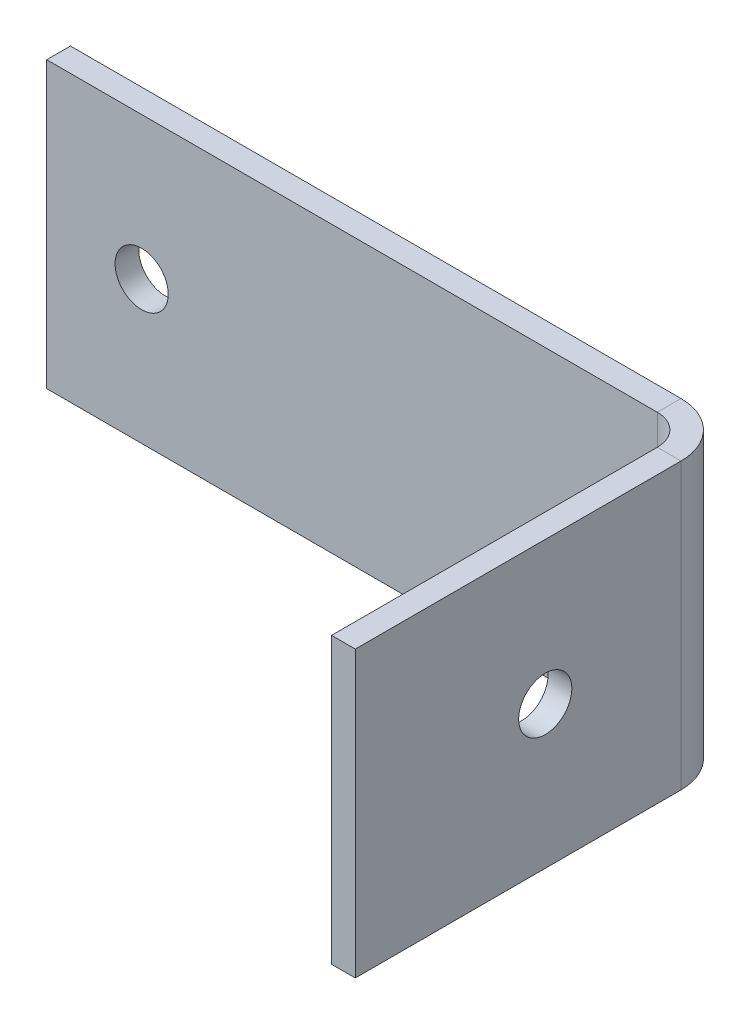
ISO-10303-21;
HEADER;
FILE_DESCRIPTION(('STEP AP214'),'2;1');
FILE_NAME('part.step','',(''),(''),'','','');
FILE_SCHEMA(('AUTOMOTIVE_DESIGN { 1 0 10303 214 1 1 1 1 }'));
ENDSEC;
DATA;
#1=APPLICATION_CONTEXT('core data for automotive mechanical design processes');
#2=APPLICATION_PROTOCOL_DEFINITION('international standard','automotive_design',2000,#1);
#3=PRODUCT_CONTEXT('',#1,'mechanical');
#4=PRODUCT('Part','Part','',(#3));
#5=PRODUCT_RELATED_PRODUCT_CATEGORY('part','',(#4));
#6=PRODUCT_DEFINITION_FORMATION('','',#4);
#7=PRODUCT_DEFINITION_CONTEXT('part definition',#1,'design');
#8=PRODUCT_DEFINITION('design','',#6,#7);
#9=PRODUCT_DEFINITION_SHAPE('','',#8);
#10=(LENGTH_UNIT() NAMED_UNIT(*) SI_UNIT(.MILLI.,.METRE.));
#11=(NAMED_UNIT(*) PLANE_ANGLE_UNIT() SI_UNIT($,.RADIAN.));
#12=(NAMED_UNIT(*) SI_UNIT($,.STERADIAN.) SOLID_ANGLE_UNIT());
#13=UNCERTAINTY_MEASURE_WITH_UNIT(LENGTH_MEASURE(1.E-05),#10,'distance_accuracy_value','');
#14=(GEOMETRIC_REPRESENTATION_CONTEXT(3) GLOBAL_UNCERTAINTY_ASSIGNED_CONTEXT((#13)) GLOBAL_UNIT_ASSIGNED_CONTEXT((#10,
#11,#12)) REPRESENTATION_CONTEXT('',''));
#15=CARTESIAN_POINT('',(0.,0.,0.));
#16=DIRECTION('',(0.,0.,1.));
#17=DIRECTION('',(1.,0.,0.));
#18=AXIS2_PLACEMENT_3D('',#15,#16,#17);
#19=CARTESIAN_POINT('',(0.,0.,3.175));
#20=DIRECTION('',(0.,0.,1.));
#21=DIRECTION('',(1.,0.,0.));
#22=AXIS2_PLACEMENT_3D('',#19,#20,#21);
#23=PLANE('',#22);
#24=CARTESIAN_POINT('',(-88.9000000000001,88.8999999999999,3.175));
#25=DIRECTION('',(0.,0.,1.));
#26=DIRECTION('',(1.,0.,0.));
#27=AXIS2_PLACEMENT_3D('',#24,#25,#26);
#28=CIRCLE('',#27,3.556);
#29=CARTESIAN_POINT('',(-85.3440000000001,88.8999999999999,3.175));
#30=VERTEX_POINT('',#29);
#31=EDGE_CURVE('E192',#30,#30,#28,.T.);
#32=ORIENTED_EDGE('',*,*,#31,.F.);
#33=EDGE_LOOP('',(#32));
#34=FACE_BOUND('',#33,.T.);
#35=DIRECTION('',(1.,0.,0.));
#36=VECTOR('',#35,1.);
#37=CARTESIAN_POINT('',(-101.6,69.8499999999999,3.175));
#38=LINE('',#37,#36);
#39=CARTESIAN_POINT('',(-101.6,69.8499999999999,3.175));
#40=VERTEX_POINT('',#39);
#41=CARTESIAN_POINT('',(-19.935,69.8499999999999,3.175));
#42=VERTEX_POINT('',#41);
#43=EDGE_CURVE('E201',#40,#42,#38,.T.);
#44=ORIENTED_EDGE('',*,*,#43,.T.);
#45=DIRECTION('',(0.,1.,0.));
#46=VECTOR('',#45,1.);
#47=CARTESIAN_POINT('',(-19.935,107.95,3.175));
#48=LINE('',#47,#46);
#49=CARTESIAN_POINT('',(-19.935,107.95,3.175));
#50=VERTEX_POINT('',#49);
#51=EDGE_CURVE('E182',#50,#42,#48,.F.);
#52=ORIENTED_EDGE('',*,*,#51,.F.);
#53=DIRECTION('',(-1.,0.,0.));
#54=VECTOR('',#53,1.);
#55=CARTESIAN_POINT('',(-101.6,107.95,3.175));
#56=LINE('',#55,#54);
#57=CARTESIAN_POINT('',(-101.6,107.95,3.175));
#58=VERTEX_POINT('',#57);
#59=EDGE_CURVE('E204',#50,#58,#56,.T.);
#60=ORIENTED_EDGE('',*,*,#59,.T.);
#61=DIRECTION('',(0.,-1.,0.));
#62=VECTOR('',#61,1.);
#63=CARTESIAN_POINT('',(-101.6,107.95,3.175));
#64=LINE('',#63,#62);
#65=EDGE_CURVE('E198',#58,#40,#64,.T.);
#66=ORIENTED_EDGE('',*,*,#65,.T.);
#67=EDGE_LOOP('',(#44,#52,#60,#66));
#68=FACE_BOUND('',#67,.T.);
#69=ADVANCED_FACE('F64',(#34,#68),#23,.T.);
#70=CARTESIAN_POINT('',(0.,0.,0.));
#71=DIRECTION('',(0.,0.,1.));
#72=DIRECTION('',(1.,0.,0.));
#73=AXIS2_PLACEMENT_3D('',#70,#71,#72);
#74=PLANE('',#73);
#75=CARTESIAN_POINT('',(-88.9000000000001,88.8999999999999,0.));
#76=DIRECTION('',(0.,0.,1.));
#77=DIRECTION('',(1.,0.,0.));
#78=AXIS2_PLACEMENT_3D('',#75,#76,#77);
#79=CIRCLE('',#78,3.556);
#80=CARTESIAN_POINT('',(-85.3440000000001,88.8999999999999,0.));
#81=VERTEX_POINT('',#80);
#82=EDGE_CURVE('E189',#81,#81,#79,.T.);
#83=ORIENTED_EDGE('',*,*,#82,.T.);
#84=EDGE_LOOP('',(#83));
#85=FACE_BOUND('',#84,.T.);
#86=DIRECTION('',(0.,1.,0.));
#87=VECTOR('',#86,1.);
#88=CARTESIAN_POINT('',(-19.935,107.95,0.));
#89=LINE('',#88,#87);
#90=CARTESIAN_POINT('',(-19.935,107.95,0.));
#91=VERTEX_POINT('',#90);
#92=CARTESIAN_POINT('',(-19.935,69.8499999999999,0.));
#93=VERTEX_POINT('',#92);
#94=EDGE_CURVE('E87',#91,#93,#89,.F.);
#95=ORIENTED_EDGE('',*,*,#94,.T.);
#96=DIRECTION('',(1.,0.,0.));
#97=VECTOR('',#96,1.);
#98=CARTESIAN_POINT('',(-101.6,69.8499999999999,0.));
#99=LINE('',#98,#97);
#100=CARTESIAN_POINT('',(-101.6,69.8499999999999,0.));
#101=VERTEX_POINT('',#100);
#102=EDGE_CURVE('E208',#101,#93,#99,.T.);
#103=ORIENTED_EDGE('',*,*,#102,.F.);
#104=DIRECTION('',(0.,-1.,0.));
#105=VECTOR('',#104,1.);
#106=CARTESIAN_POINT('',(-101.6,107.95,0.));
#107=LINE('',#106,#105);
#108=CARTESIAN_POINT('',(-101.6,107.95,0.));
#109=VERTEX_POINT('',#108);
#110=EDGE_CURVE('E195',#109,#101,#107,.T.);
#111=ORIENTED_EDGE('',*,*,#110,.F.);
#112=DIRECTION('',(-1.,0.,0.));
#113=VECTOR('',#112,1.);
#114=CARTESIAN_POINT('',(-101.6,107.95,0.));
#115=LINE('',#114,#113);
#116=EDGE_CURVE('E202',#91,#109,#115,.T.);
#117=ORIENTED_EDGE('',*,*,#116,.F.);
#118=EDGE_LOOP('',(#95,#103,#111,#117));
#119=FACE_BOUND('',#118,.T.);
#120=ADVANCED_FACE('F217',(#85,#119),#74,.F.);
#121=CARTESIAN_POINT('',(-101.6,69.8499999999999,3.175));
#122=DIRECTION('',(0.,1.,0.));
#123=DIRECTION('',(0.,0.,1.));
#124=AXIS2_PLACEMENT_3D('',#121,#122,#123);
#125=PLANE('',#124);
#126=DIRECTION('',(0.,0.,-1.));
#127=VECTOR('',#126,1.);
#128=CARTESIAN_POINT('',(-19.935,69.8499999999999,3.175));
#129=LINE('',#128,#127);
#130=EDGE_CURVE('E79',#42,#93,#129,.T.);
#131=ORIENTED_EDGE('',*,*,#130,.F.);
#132=ORIENTED_EDGE('',*,*,#43,.F.);
#133=DIRECTION('',(0.,0.,-1.));
#134=VECTOR('',#133,1.);
#135=CARTESIAN_POINT('',(-101.6,69.8499999999999,3.175));
#136=LINE('',#135,#134);
#137=EDGE_CURVE('E13',#40,#101,#136,.T.);
#138=ORIENTED_EDGE('',*,*,#137,.T.);
#139=ORIENTED_EDGE('',*,*,#102,.T.);
#140=EDGE_LOOP('',(#131,#132,#138,#139));
#141=FACE_BOUND('',#140,.T.);
#142=ADVANCED_FACE('F218',(#141),#125,.F.);
#143=CARTESIAN_POINT('',(-101.6,107.95,3.175));
#144=DIRECTION('',(0.,-1.,0.));
#145=DIRECTION('',(0.,0.,-1.));
#146=AXIS2_PLACEMENT_3D('',#143,#144,#145);
#147=PLANE('',#146);
#148=DIRECTION('',(0.,0.,-1.));
#149=VECTOR('',#148,1.);
#150=CARTESIAN_POINT('',(-19.935,107.95,3.175));
#151=LINE('',#150,#149);
#152=EDGE_CURVE('E176',#50,#91,#151,.T.);
#153=ORIENTED_EDGE('',*,*,#152,.T.);
#154=ORIENTED_EDGE('',*,*,#116,.T.);
#155=DIRECTION('',(0.,0.,-1.));
#156=VECTOR('',#155,1.);
#157=CARTESIAN_POINT('',(-101.6,107.95,3.175));
#158=LINE('',#157,#156);
#159=EDGE_CURVE('E72',#58,#109,#158,.T.);
#160=ORIENTED_EDGE('',*,*,#159,.F.);
#161=ORIENTED_EDGE('',*,*,#59,.F.);
#162=EDGE_LOOP('',(#153,#154,#160,#161));
#163=FACE_BOUND('',#162,.T.);
#164=ADVANCED_FACE('F222',(#163),#147,.F.);
#165=CARTESIAN_POINT('',(-101.6,107.95,3.175));
#166=DIRECTION('',(1.,0.,0.));
#167=DIRECTION('',(0.,0.,-1.));
#168=AXIS2_PLACEMENT_3D('',#165,#166,#167);
#169=PLANE('',#168);
#170=ORIENTED_EDGE('',*,*,#110,.T.);
#171=ORIENTED_EDGE('',*,*,#137,.F.);
#172=ORIENTED_EDGE('',*,*,#65,.F.);
#173=ORIENTED_EDGE('',*,*,#159,.T.);
#174=EDGE_LOOP('',(#170,#171,#172,#173));
#175=FACE_BOUND('',#174,.T.);
#176=ADVANCED_FACE('F66',(#175),#169,.F.);
#177=CARTESIAN_POINT('',(-88.9000000000001,88.8999999999999,3.175));
#178=DIRECTION('',(0.,0.,-1.));
#179=DIRECTION('',(-1.,0.,0.));
#180=AXIS2_PLACEMENT_3D('',#177,#178,#179);
#181=CYLINDRICAL_SURFACE('',#180,3.556);
#182=ORIENTED_EDGE('',*,*,#31,.T.);
#183=EDGE_LOOP('',(#182));
#184=FACE_BOUND('',#183,.T.);
#185=ORIENTED_EDGE('',*,*,#82,.F.);
#186=EDGE_LOOP('',(#185));
#187=FACE_BOUND('',#186,.T.);
#188=ADVANCED_FACE('F259',(#184,#187),#181,.F.);
#189=CARTESIAN_POINT('',(-19.935,69.8499999999999,7.235));
#190=DIRECTION('',(0.,-1.,0.));
#191=DIRECTION('',(0.,0.,-1.));
#192=AXIS2_PLACEMENT_3D('',#189,#190,#191);
#193=PLANE('',#192);
#194=DIRECTION('',(-1.,0.,0.));
#195=VECTOR('',#194,1.);
#196=CARTESIAN_POINT('',(-12.7,69.8499999999999,7.23499999999998));
#197=LINE('',#196,#195);
#198=CARTESIAN_POINT('',(-15.875,69.8499999999999,7.23499999999999));
#199=VERTEX_POINT('',#198);
#200=CARTESIAN_POINT('',(-12.7,69.8499999999999,7.23499999999998));
#201=VERTEX_POINT('',#200);
#202=EDGE_CURVE('E153',#199,#201,#197,.F.);
#203=ORIENTED_EDGE('',*,*,#202,.F.);
#204=CARTESIAN_POINT('',(-19.935,69.8499999999999,7.235));
#205=DIRECTION('',(0.,1.,0.));
#206=DIRECTION('',(0.,0.,1.));
#207=AXIS2_PLACEMENT_3D('',#204,#205,#206);
#208=CIRCLE('',#207,4.06);
#209=EDGE_CURVE('E179',#42,#199,#208,.F.);
#210=ORIENTED_EDGE('',*,*,#209,.F.);
#211=ORIENTED_EDGE('',*,*,#130,.T.);
#212=CARTESIAN_POINT('',(-19.935,69.8499999999999,7.235));
#213=DIRECTION('',(0.,1.,0.));
#214=DIRECTION('',(0.,0.,1.));
#215=AXIS2_PLACEMENT_3D('',#212,#213,#214);
#216=CIRCLE('',#215,7.235);
#217=EDGE_CURVE('E172',#93,#201,#216,.F.);
#218=ORIENTED_EDGE('',*,*,#217,.T.);
#219=EDGE_LOOP('',(#203,#210,#211,#218));
#220=FACE_BOUND('',#219,.T.);
#221=ADVANCED_FACE('F257',(#220),#193,.T.);
#222=CARTESIAN_POINT('',(-19.935,107.95,7.235));
#223=DIRECTION('',(0.,-1.,0.));
#224=DIRECTION('',(0.,0.,-1.));
#225=AXIS2_PLACEMENT_3D('',#222,#223,#224);
#226=PLANE('',#225);
#227=CARTESIAN_POINT('',(-19.935,107.95,7.235));
#228=DIRECTION('',(0.,1.,0.));
#229=DIRECTION('',(0.,0.,1.));
#230=AXIS2_PLACEMENT_3D('',#227,#228,#229);
#231=CIRCLE('',#230,4.06);
#232=CARTESIAN_POINT('',(-15.875,107.95,7.23499999999999));
#233=VERTEX_POINT('',#232);
#234=EDGE_CURVE('E185',#233,#50,#231,.T.);
#235=ORIENTED_EDGE('',*,*,#234,.F.);
#236=DIRECTION('',(-1.,0.,0.));
#237=VECTOR('',#236,1.);
#238=CARTESIAN_POINT('',(-15.875,107.95,7.23499999999999));
#239=LINE('',#238,#237);
#240=CARTESIAN_POINT('',(-12.7,107.95,7.23499999999998));
#241=VERTEX_POINT('',#240);
#242=EDGE_CURVE('E164',#233,#241,#239,.F.);
#243=ORIENTED_EDGE('',*,*,#242,.T.);
#244=CARTESIAN_POINT('',(-19.935,107.95,7.235));
#245=DIRECTION('',(0.,1.,0.));
#246=DIRECTION('',(0.,0.,1.));
#247=AXIS2_PLACEMENT_3D('',#244,#245,#246);
#248=CIRCLE('',#247,7.235);
#249=EDGE_CURVE('E173',#241,#91,#248,.T.);
#250=ORIENTED_EDGE('',*,*,#249,.T.);
#251=ORIENTED_EDGE('',*,*,#152,.F.);
#252=EDGE_LOOP('',(#235,#243,#250,#251));
#253=FACE_BOUND('',#252,.T.);
#254=ADVANCED_FACE('F228',(#253),#226,.F.);
#255=CARTESIAN_POINT('',(-19.935,107.95,7.235));
#256=DIRECTION('',(0.,1.,0.));
#257=DIRECTION('',(1.,0.,0.));
#258=AXIS2_PLACEMENT_3D('',#255,#256,#257);
#259=CYLINDRICAL_SURFACE('',#258,7.235);
#260=ORIENTED_EDGE('',*,*,#94,.F.);
#261=ORIENTED_EDGE('',*,*,#249,.F.);
#262=DIRECTION('',(0.,1.,0.));
#263=VECTOR('',#262,1.);
#264=CARTESIAN_POINT('',(-12.7,69.8499999999999,7.23499999999998));
#265=LINE('',#264,#263);
#266=EDGE_CURVE('E162',#241,#201,#265,.F.);
#267=ORIENTED_EDGE('',*,*,#266,.T.);
#268=ORIENTED_EDGE('',*,*,#217,.F.);
#269=EDGE_LOOP('',(#260,#261,#267,#268));
#270=FACE_BOUND('',#269,.T.);
#271=ADVANCED_FACE('F227',(#270),#259,.T.);
#272=CARTESIAN_POINT('',(-19.935,107.95,7.235));
#273=DIRECTION('',(0.,1.,0.));
#274=DIRECTION('',(1.,0.,0.));
#275=AXIS2_PLACEMENT_3D('',#272,#273,#274);
#276=CYLINDRICAL_SURFACE('',#275,4.06);
#277=ORIENTED_EDGE('',*,*,#51,.T.);
#278=ORIENTED_EDGE('',*,*,#209,.T.);
#279=DIRECTION('',(0.,1.,0.));
#280=VECTOR('',#279,1.);
#281=CARTESIAN_POINT('',(-15.875,69.8499999999999,7.23499999999999));
#282=LINE('',#281,#280);
#283=EDGE_CURVE('E167',#199,#233,#282,.T.);
#284=ORIENTED_EDGE('',*,*,#283,.T.);
#285=ORIENTED_EDGE('',*,*,#234,.T.);
#286=EDGE_LOOP('',(#277,#278,#284,#285));
#287=FACE_BOUND('',#286,.T.);
#288=ADVANCED_FACE('F254',(#287),#276,.F.);
#289=CARTESIAN_POINT('',(-12.7,69.8499999999999,3.17499999999999));
#290=DIRECTION('',(0.,1.,0.));
#291=DIRECTION('',(0.,0.,1.));
#292=AXIS2_PLACEMENT_3D('',#289,#290,#291);
#293=PLANE('',#292);
#294=ORIENTED_EDGE('',*,*,#202,.T.);
#295=DIRECTION('',(0.,0.,-1.));
#296=VECTOR('',#295,1.);
#297=CARTESIAN_POINT('',(-12.7,69.8499999999999,0.));
#298=LINE('',#297,#296);
#299=CARTESIAN_POINT('',(-12.6999999999999,69.8499999999999,50.7999999999996));
#300=VERTEX_POINT('',#299);
#301=EDGE_CURVE('E134',#300,#201,#298,.T.);
#302=ORIENTED_EDGE('',*,*,#301,.F.);
#303=DIRECTION('',(-1.,0.,0.));
#304=VECTOR('',#303,1.);
#305=CARTESIAN_POINT('',(-12.6999999999999,69.8499999999999,50.7999999999996));
#306=LINE('',#305,#304);
#307=CARTESIAN_POINT('',(-15.8749999999999,69.8499999999999,50.7999999999996));
#308=VERTEX_POINT('',#307);
#309=EDGE_CURVE('E140',#300,#308,#306,.T.);
#310=ORIENTED_EDGE('',*,*,#309,.T.);
#311=DIRECTION('',(0.,0.,1.));
#312=VECTOR('',#311,1.);
#313=CARTESIAN_POINT('',(-15.875,69.8499999999999,3.175));
#314=LINE('',#313,#312);
#315=EDGE_CURVE('E160',#308,#199,#314,.F.);
#316=ORIENTED_EDGE('',*,*,#315,.T.);
#317=EDGE_LOOP('',(#294,#302,#310,#316));
#318=FACE_BOUND('',#317,.T.);
#319=ADVANCED_FACE('F152',(#318),#293,.F.);
#320=CARTESIAN_POINT('',(-12.6999999999999,107.95,50.7999999999996));
#321=DIRECTION('',(0.,-1.,0.));
#322=DIRECTION('',(0.,0.,-1.));
#323=AXIS2_PLACEMENT_3D('',#320,#321,#322);
#324=PLANE('',#323);
#325=ORIENTED_EDGE('',*,*,#242,.F.);
#326=DIRECTION('',(0.,0.,-1.));
#327=VECTOR('',#326,1.);
#328=CARTESIAN_POINT('',(-15.8749999999999,107.95,50.7999999999996));
#329=LINE('',#328,#327);
#330=CARTESIAN_POINT('',(-15.8749999999999,107.95,50.7999999999996));
#331=VERTEX_POINT('',#330);
#332=EDGE_CURVE('E156',#233,#331,#329,.F.);
#333=ORIENTED_EDGE('',*,*,#332,.T.);
#334=DIRECTION('',(-1.,0.,0.));
#335=VECTOR('',#334,1.);
#336=CARTESIAN_POINT('',(-12.6999999999999,107.95,50.7999999999996));
#337=LINE('',#336,#335);
#338=CARTESIAN_POINT('',(-12.6999999999999,107.95,50.7999999999996));
#339=VERTEX_POINT('',#338);
#340=EDGE_CURVE('E149',#339,#331,#337,.T.);
#341=ORIENTED_EDGE('',*,*,#340,.F.);
#342=DIRECTION('',(0.,0.,1.));
#343=VECTOR('',#342,1.);
#344=CARTESIAN_POINT('',(-12.7,107.95,0.));
#345=LINE('',#344,#343);
#346=EDGE_CURVE('E136',#241,#339,#345,.T.);
#347=ORIENTED_EDGE('',*,*,#346,.F.);
#348=EDGE_LOOP('',(#325,#333,#341,#347));
#349=FACE_BOUND('',#348,.T.);
#350=ADVANCED_FACE('F232',(#349),#324,.F.);
#351=CARTESIAN_POINT('',(-12.7,0.,0.));
#352=DIRECTION('',(-1.,0.,0.));
#353=DIRECTION('',(0.,0.,1.));
#354=AXIS2_PLACEMENT_3D('',#351,#352,#353);
#355=PLANE('',#354);
#356=CARTESIAN_POINT('',(-12.6999999999998,88.8999999999999,25.3999999999999));
#357=DIRECTION('',(-1.,0.,0.));
#358=DIRECTION('',(0.,0.,1.));
#359=AXIS2_PLACEMENT_3D('',#356,#357,#358);
#360=CIRCLE('',#359,3.556);
#361=CARTESIAN_POINT('',(-12.6999999999998,88.8999999999999,28.9559999999999));
#362=VERTEX_POINT('',#361);
#363=EDGE_CURVE('E170',#362,#362,#360,.T.);
#364=ORIENTED_EDGE('',*,*,#363,.T.);
#365=EDGE_LOOP('',(#364));
#366=FACE_BOUND('',#365,.T.);
#367=ORIENTED_EDGE('',*,*,#266,.F.);
#368=ORIENTED_EDGE('',*,*,#346,.T.);
#369=DIRECTION('',(0.,-1.,0.));
#370=VECTOR('',#369,1.);
#371=CARTESIAN_POINT('',(-12.6999999999999,0.,50.7999999999996));
#372=LINE('',#371,#370);
#373=EDGE_CURVE('E129',#339,#300,#372,.T.);
#374=ORIENTED_EDGE('',*,*,#373,.T.);
#375=ORIENTED_EDGE('',*,*,#301,.T.);
#376=EDGE_LOOP('',(#367,#368,#374,#375));
#377=FACE_BOUND('',#376,.T.);
#378=ADVANCED_FACE('F132',(#366,#377),#355,.F.);
#379=CARTESIAN_POINT('',(-15.875,0.,0.));
#380=DIRECTION('',(-1.,0.,0.));
#381=DIRECTION('',(0.,0.,1.));
#382=AXIS2_PLACEMENT_3D('',#379,#380,#381);
#383=PLANE('',#382);
#384=CARTESIAN_POINT('',(-15.875,88.8999999999999,25.3999999999999));
#385=DIRECTION('',(-1.,0.,0.));
#386=DIRECTION('',(0.,0.,1.));
#387=AXIS2_PLACEMENT_3D('',#384,#385,#386);
#388=CIRCLE('',#387,3.556);
#389=CARTESIAN_POINT('',(-15.8749999999999,88.8999999999999,28.9559999999999));
#390=VERTEX_POINT('',#389);
#391=EDGE_CURVE('E235',#390,#390,#388,.T.);
#392=ORIENTED_EDGE('',*,*,#391,.F.);
#393=EDGE_LOOP('',(#392));
#394=FACE_BOUND('',#393,.T.);
#395=ORIENTED_EDGE('',*,*,#332,.F.);
#396=ORIENTED_EDGE('',*,*,#283,.F.);
#397=ORIENTED_EDGE('',*,*,#315,.F.);
#398=DIRECTION('',(0.,1.,0.));
#399=VECTOR('',#398,1.);
#400=CARTESIAN_POINT('',(-15.8749999999999,69.8499999999999,50.7999999999996));
#401=LINE('',#400,#399);
#402=EDGE_CURVE('E145',#331,#308,#401,.F.);
#403=ORIENTED_EDGE('',*,*,#402,.F.);
#404=EDGE_LOOP('',(#395,#396,#397,#403));
#405=FACE_BOUND('',#404,.T.);
#406=ADVANCED_FACE('F248',(#394,#405),#383,.T.);
#407=CARTESIAN_POINT('',(-12.6999999999999,69.8499999999999,50.7999999999996));
#408=DIRECTION('',(0.,0.,-1.));
#409=DIRECTION('',(-1.,0.,0.));
#410=AXIS2_PLACEMENT_3D('',#407,#408,#409);
#411=PLANE('',#410);
#412=ORIENTED_EDGE('',*,*,#402,.T.);
#413=ORIENTED_EDGE('',*,*,#309,.F.);
#414=ORIENTED_EDGE('',*,*,#373,.F.);
#415=ORIENTED_EDGE('',*,*,#340,.T.);
#416=EDGE_LOOP('',(#412,#413,#414,#415));
#417=FACE_BOUND('',#416,.T.);
#418=ADVANCED_FACE('F143',(#417),#411,.F.);
#419=CARTESIAN_POINT('',(-12.6999999999998,88.8999999999999,25.3999999999999));
#420=DIRECTION('',(-1.,0.,0.));
#421=DIRECTION('',(0.,0.,1.));
#422=AXIS2_PLACEMENT_3D('',#419,#420,#421);
#423=CYLINDRICAL_SURFACE('',#422,3.556);
#424=ORIENTED_EDGE('',*,*,#363,.F.);
#425=EDGE_LOOP('',(#424));
#426=FACE_BOUND('',#425,.T.);
#427=ORIENTED_EDGE('',*,*,#391,.T.);
#428=EDGE_LOOP('',(#427));
#429=FACE_BOUND('',#428,.T.);
#430=ADVANCED_FACE('F242',(#426,#429),#423,.F.);
#431=CLOSED_SHELL('',(#69,#120,#142,#164,#176,#188,#221,#254,#271,#288,#319,#350,#378,#406,#418,#430));
#432=MANIFOLD_SOLID_BREP('B2',#431);
#433=ADVANCED_BREP_SHAPE_REPRESENTATION('',(#18,#432),#14);
#434=SHAPE_DEFINITION_REPRESENTATION(#9,#433);
ENDSEC;
END-ISO-10303-21;
